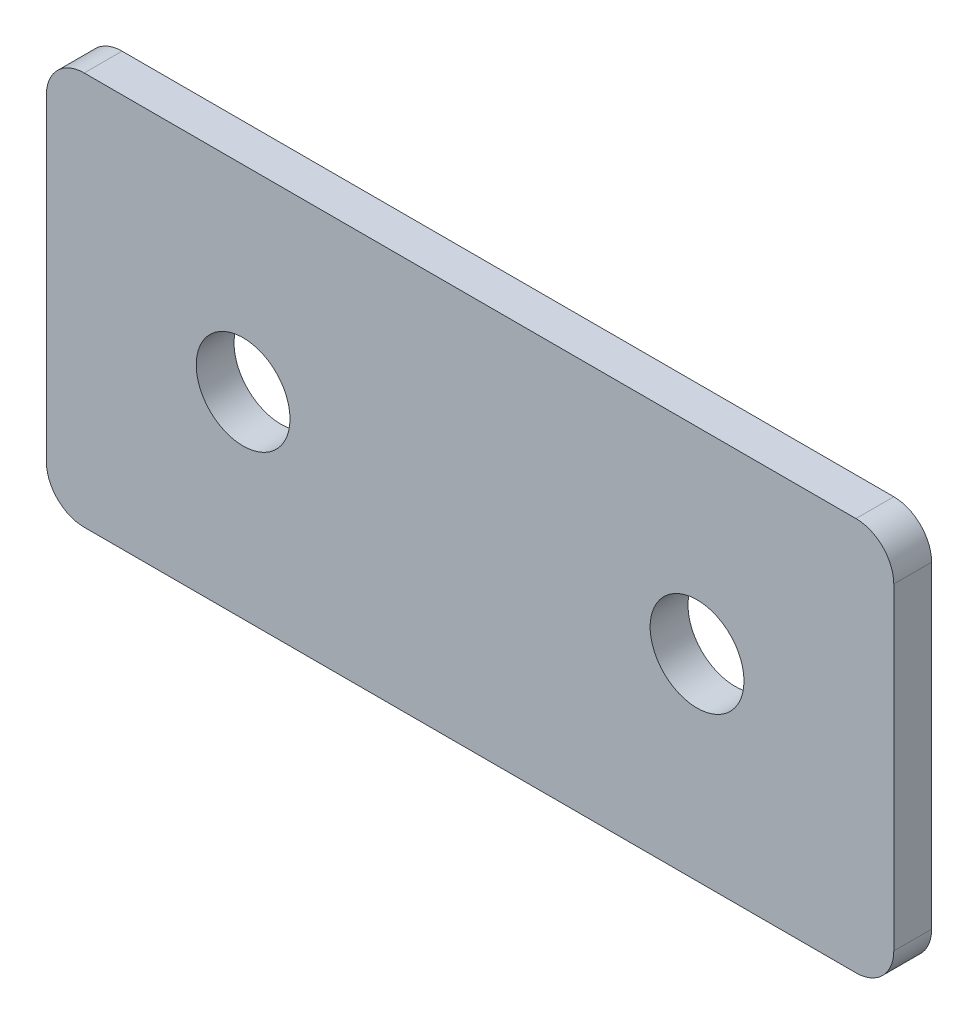
ISO-10303-21;
HEADER;
FILE_DESCRIPTION(('STEP AP214'),'2;1');
FILE_NAME('part.step','',(''),(''),'','','');
FILE_SCHEMA(('AUTOMOTIVE_DESIGN { 1 0 10303 214 1 1 1 1 }'));
ENDSEC;
DATA;
#1=APPLICATION_CONTEXT('core data for automotive mechanical design processes');
#2=APPLICATION_PROTOCOL_DEFINITION('international standard','automotive_design',2000,#1);
#3=PRODUCT_CONTEXT('',#1,'mechanical');
#4=PRODUCT('Part','Part','',(#3));
#5=PRODUCT_RELATED_PRODUCT_CATEGORY('part','',(#4));
#6=PRODUCT_DEFINITION_FORMATION('','',#4);
#7=PRODUCT_DEFINITION_CONTEXT('part definition',#1,'design');
#8=PRODUCT_DEFINITION('design','',#6,#7);
#9=PRODUCT_DEFINITION_SHAPE('','',#8);
#10=(LENGTH_UNIT() NAMED_UNIT(*) SI_UNIT(.MILLI.,.METRE.));
#11=(NAMED_UNIT(*) PLANE_ANGLE_UNIT() SI_UNIT($,.RADIAN.));
#12=(NAMED_UNIT(*) SI_UNIT($,.STERADIAN.) SOLID_ANGLE_UNIT());
#13=UNCERTAINTY_MEASURE_WITH_UNIT(LENGTH_MEASURE(1.E-05),#10,'distance_accuracy_value','');
#14=(GEOMETRIC_REPRESENTATION_CONTEXT(3) GLOBAL_UNCERTAINTY_ASSIGNED_CONTEXT((#13)) GLOBAL_UNIT_ASSIGNED_CONTEXT((#10,
#11,#12)) REPRESENTATION_CONTEXT('',''));
#15=CARTESIAN_POINT('',(0.,0.,0.));
#16=DIRECTION('',(0.,0.,1.));
#17=DIRECTION('',(1.,0.,0.));
#18=AXIS2_PLACEMENT_3D('',#15,#16,#17);
#19=CARTESIAN_POINT('',(-16.3611704944196,1.29837341341953,1.31300808576043));
#20=DIRECTION('',(0.,0.,-1.));
#21=DIRECTION('',(-1.,0.,0.));
#22=AXIS2_PLACEMENT_3D('',#19,#20,#21);
#23=PLANE('',#22);
#24=CARTESIAN_POINT('',(13.6388295055804,1.29837341341954,1.31300808576043));
#25=DIRECTION('',(0.,0.,1.));
#26=DIRECTION('',(1.,0.,0.));
#27=AXIS2_PLACEMENT_3D('',#24,#25,#26);
#28=CIRCLE('',#27,3.1);
#29=CARTESIAN_POINT('',(16.7388295055804,1.29837341341954,1.31300808576043));
#30=VERTEX_POINT('',#29);
#31=EDGE_CURVE('E154',#30,#30,#28,.T.);
#32=ORIENTED_EDGE('',*,*,#31,.F.);
#33=EDGE_LOOP('',(#32));
#34=FACE_BOUND('',#33,.T.);
#35=CARTESIAN_POINT('',(-16.3611704944196,1.29837341341954,1.31300808576043));
#36=DIRECTION('',(0.,0.,1.));
#37=DIRECTION('',(1.,0.,0.));
#38=AXIS2_PLACEMENT_3D('',#35,#36,#37);
#39=CIRCLE('',#38,3.1);
#40=CARTESIAN_POINT('',(-13.2611704944196,1.29837341341954,1.31300808576043));
#41=VERTEX_POINT('',#40);
#42=EDGE_CURVE('E107',#41,#41,#39,.T.);
#43=ORIENTED_EDGE('',*,*,#42,.F.);
#44=EDGE_LOOP('',(#43));
#45=FACE_BOUND('',#44,.T.);
#46=DIRECTION('',(1.,0.,0.));
#47=VECTOR('',#46,1.);
#48=CARTESIAN_POINT('',(-29.3611704944196,-11.7016265865805,1.31300808576043));
#49=LINE('',#48,#47);
#50=CARTESIAN_POINT('',(-26.8611704944196,-11.7016265865805,1.31300808576043));
#51=VERTEX_POINT('',#50);
#52=CARTESIAN_POINT('',(24.1388295055803,-11.7016265865805,1.31300808576043));
#53=VERTEX_POINT('',#52);
#54=EDGE_CURVE('E84',#51,#53,#49,.T.);
#55=ORIENTED_EDGE('',*,*,#54,.T.);
#56=CARTESIAN_POINT('',(24.1388295055804,-9.20162658658046,1.31300808576043));
#57=DIRECTION('',(0.,0.,-1.));
#58=DIRECTION('',(-1.,0.,0.));
#59=AXIS2_PLACEMENT_3D('',#56,#57,#58);
#60=CIRCLE('',#59,2.5);
#61=CARTESIAN_POINT('',(26.6388295055804,-9.20162658658046,1.31300808576043));
#62=VERTEX_POINT('',#61);
#63=EDGE_CURVE('E91',#53,#62,#60,.F.);
#64=ORIENTED_EDGE('',*,*,#63,.T.);
#65=DIRECTION('',(0.,1.,0.));
#66=VECTOR('',#65,1.);
#67=CARTESIAN_POINT('',(26.6388295055804,-11.7016265865805,1.31300808576043));
#68=LINE('',#67,#66);
#69=CARTESIAN_POINT('',(26.6388295055804,11.7983734134195,1.31300808576043));
#70=VERTEX_POINT('',#69);
#71=EDGE_CURVE('E102',#62,#70,#68,.T.);
#72=ORIENTED_EDGE('',*,*,#71,.T.);
#73=CARTESIAN_POINT('',(24.1388295055804,11.7983734134195,1.31300808576043));
#74=DIRECTION('',(0.,0.,-1.));
#75=DIRECTION('',(-1.,0.,0.));
#76=AXIS2_PLACEMENT_3D('',#73,#74,#75);
#77=CIRCLE('',#76,2.5);
#78=CARTESIAN_POINT('',(24.1388295055804,14.2983734134195,1.31300808576043));
#79=VERTEX_POINT('',#78);
#80=EDGE_CURVE('E109',#70,#79,#77,.F.);
#81=ORIENTED_EDGE('',*,*,#80,.T.);
#82=DIRECTION('',(-1.,0.,0.));
#83=VECTOR('',#82,1.);
#84=CARTESIAN_POINT('',(26.6388295055804,14.2983734134195,1.31300808576043));
#85=LINE('',#84,#83);
#86=CARTESIAN_POINT('',(-26.8611704944196,14.2983734134195,1.31300808576043));
#87=VERTEX_POINT('',#86);
#88=EDGE_CURVE('E139',#79,#87,#85,.T.);
#89=ORIENTED_EDGE('',*,*,#88,.T.);
#90=CARTESIAN_POINT('',(-26.8611704944196,11.7983734134195,1.31300808576043));
#91=DIRECTION('',(0.,0.,-1.));
#92=DIRECTION('',(-1.,0.,0.));
#93=AXIS2_PLACEMENT_3D('',#90,#91,#92);
#94=CIRCLE('',#93,2.5);
#95=CARTESIAN_POINT('',(-29.3611704944196,11.7983734134195,1.31300808576043));
#96=VERTEX_POINT('',#95);
#97=EDGE_CURVE('E92',#87,#96,#94,.F.);
#98=ORIENTED_EDGE('',*,*,#97,.T.);
#99=DIRECTION('',(0.,-1.,0.));
#100=VECTOR('',#99,1.);
#101=CARTESIAN_POINT('',(-29.3611704944196,14.2983734134195,1.31300808576043));
#102=LINE('',#101,#100);
#103=CARTESIAN_POINT('',(-29.3611704944196,-9.20162658658045,1.31300808576043));
#104=VERTEX_POINT('',#103);
#105=EDGE_CURVE('E86',#96,#104,#102,.T.);
#106=ORIENTED_EDGE('',*,*,#105,.T.);
#107=CARTESIAN_POINT('',(-26.8611704944196,-9.20162658658046,1.31300808576043));
#108=DIRECTION('',(0.,0.,-1.));
#109=DIRECTION('',(-1.,0.,0.));
#110=AXIS2_PLACEMENT_3D('',#107,#108,#109);
#111=CIRCLE('',#110,2.5);
#112=EDGE_CURVE('E82',#104,#51,#111,.F.);
#113=ORIENTED_EDGE('',*,*,#112,.T.);
#114=EDGE_LOOP('',(#55,#64,#72,#81,#89,#98,#106,#113));
#115=FACE_BOUND('',#114,.T.);
#116=ADVANCED_FACE('F16',(#34,#45,#115),#23,.F.);
#117=CARTESIAN_POINT('',(-16.3611704944196,1.29837341341953,-1.18699191423957));
#118=DIRECTION('',(0.,0.,-1.));
#119=DIRECTION('',(-1.,0.,0.));
#120=AXIS2_PLACEMENT_3D('',#117,#118,#119);
#121=PLANE('',#120);
#122=CARTESIAN_POINT('',(13.6388295055804,1.29837341341954,-1.18699191423957));
#123=DIRECTION('',(0.,0.,1.));
#124=DIRECTION('',(1.,0.,0.));
#125=AXIS2_PLACEMENT_3D('',#122,#123,#124);
#126=CIRCLE('',#125,3.1);
#127=CARTESIAN_POINT('',(16.7388295055804,1.29837341341954,-1.18699191423957));
#128=VERTEX_POINT('',#127);
#129=EDGE_CURVE('E150',#128,#128,#126,.T.);
#130=ORIENTED_EDGE('',*,*,#129,.T.);
#131=EDGE_LOOP('',(#130));
#132=FACE_BOUND('',#131,.T.);
#133=CARTESIAN_POINT('',(-16.3611704944196,1.29837341341954,-1.18699191423957));
#134=DIRECTION('',(0.,0.,1.));
#135=DIRECTION('',(1.,0.,0.));
#136=AXIS2_PLACEMENT_3D('',#133,#134,#135);
#137=CIRCLE('',#136,3.1);
#138=CARTESIAN_POINT('',(-13.2611704944196,1.29837341341954,-1.18699191423957));
#139=VERTEX_POINT('',#138);
#140=EDGE_CURVE('E112',#139,#139,#137,.T.);
#141=ORIENTED_EDGE('',*,*,#140,.T.);
#142=EDGE_LOOP('',(#141));
#143=FACE_BOUND('',#142,.T.);
#144=DIRECTION('',(0.,1.,0.));
#145=VECTOR('',#144,1.);
#146=CARTESIAN_POINT('',(26.6388295055804,-11.7016265865805,-1.18699191423957));
#147=LINE('',#146,#145);
#148=CARTESIAN_POINT('',(26.6388295055804,-9.20162658658046,-1.18699191423957));
#149=VERTEX_POINT('',#148);
#150=CARTESIAN_POINT('',(26.6388295055804,11.7983734134195,-1.18699191423957));
#151=VERTEX_POINT('',#150);
#152=EDGE_CURVE('E141',#149,#151,#147,.T.);
#153=ORIENTED_EDGE('',*,*,#152,.F.);
#154=CARTESIAN_POINT('',(24.1388295055804,-9.20162658658046,-1.18699191423957));
#155=DIRECTION('',(0.,0.,-1.));
#156=DIRECTION('',(-1.,0.,0.));
#157=AXIS2_PLACEMENT_3D('',#154,#155,#156);
#158=CIRCLE('',#157,2.5);
#159=CARTESIAN_POINT('',(24.1388295055803,-11.7016265865805,-1.18699191423957));
#160=VERTEX_POINT('',#159);
#161=EDGE_CURVE('E128',#149,#160,#158,.T.);
#162=ORIENTED_EDGE('',*,*,#161,.T.);
#163=DIRECTION('',(1.,0.,0.));
#164=VECTOR('',#163,1.);
#165=CARTESIAN_POINT('',(-29.3611704944196,-11.7016265865805,-1.18699191423957));
#166=LINE('',#165,#164);
#167=CARTESIAN_POINT('',(-26.8611704944196,-11.7016265865805,-1.18699191423957));
#168=VERTEX_POINT('',#167);
#169=EDGE_CURVE('E138',#168,#160,#166,.T.);
#170=ORIENTED_EDGE('',*,*,#169,.F.);
#171=CARTESIAN_POINT('',(-26.8611704944196,-9.20162658658046,-1.18699191423957));
#172=DIRECTION('',(0.,0.,-1.));
#173=DIRECTION('',(-1.,0.,0.));
#174=AXIS2_PLACEMENT_3D('',#171,#172,#173);
#175=CIRCLE('',#174,2.5);
#176=CARTESIAN_POINT('',(-29.3611704944196,-9.20162658658045,-1.18699191423957));
#177=VERTEX_POINT('',#176);
#178=EDGE_CURVE('E106',#168,#177,#175,.T.);
#179=ORIENTED_EDGE('',*,*,#178,.T.);
#180=DIRECTION('',(0.,-1.,0.));
#181=VECTOR('',#180,1.);
#182=CARTESIAN_POINT('',(-29.3611704944196,14.2983734134195,-1.18699191423957));
#183=LINE('',#182,#181);
#184=CARTESIAN_POINT('',(-29.3611704944196,11.7983734134195,-1.18699191423957));
#185=VERTEX_POINT('',#184);
#186=EDGE_CURVE('E137',#185,#177,#183,.T.);
#187=ORIENTED_EDGE('',*,*,#186,.F.);
#188=CARTESIAN_POINT('',(-26.8611704944196,11.7983734134195,-1.18699191423957));
#189=DIRECTION('',(0.,0.,-1.));
#190=DIRECTION('',(-1.,0.,0.));
#191=AXIS2_PLACEMENT_3D('',#188,#189,#190);
#192=CIRCLE('',#191,2.5);
#193=CARTESIAN_POINT('',(-26.8611704944196,14.2983734134195,-1.18699191423957));
#194=VERTEX_POINT('',#193);
#195=EDGE_CURVE('E31',#185,#194,#192,.T.);
#196=ORIENTED_EDGE('',*,*,#195,.T.);
#197=DIRECTION('',(-1.,0.,0.));
#198=VECTOR('',#197,1.);
#199=CARTESIAN_POINT('',(26.6388295055804,14.2983734134195,-1.18699191423957));
#200=LINE('',#199,#198);
#201=CARTESIAN_POINT('',(24.1388295055804,14.2983734134195,-1.18699191423957));
#202=VERTEX_POINT('',#201);
#203=EDGE_CURVE('E148',#202,#194,#200,.T.);
#204=ORIENTED_EDGE('',*,*,#203,.F.);
#205=CARTESIAN_POINT('',(24.1388295055804,11.7983734134195,-1.18699191423957));
#206=DIRECTION('',(0.,0.,-1.));
#207=DIRECTION('',(-1.,0.,0.));
#208=AXIS2_PLACEMENT_3D('',#205,#206,#207);
#209=CIRCLE('',#208,2.5);
#210=EDGE_CURVE('E124',#202,#151,#209,.T.);
#211=ORIENTED_EDGE('',*,*,#210,.T.);
#212=EDGE_LOOP('',(#153,#162,#170,#179,#187,#196,#204,#211));
#213=FACE_BOUND('',#212,.T.);
#214=ADVANCED_FACE('F160',(#132,#143,#213),#121,.T.);
#215=CARTESIAN_POINT('',(-16.3611704944196,1.29837341341954,1.31300808576043));
#216=DIRECTION('',(0.,0.,-1.));
#217=DIRECTION('',(-1.,0.,0.));
#218=AXIS2_PLACEMENT_3D('',#215,#216,#217);
#219=CYLINDRICAL_SURFACE('',#218,3.1);
#220=ORIENTED_EDGE('',*,*,#42,.T.);
#221=EDGE_LOOP('',(#220));
#222=FACE_BOUND('',#221,.T.);
#223=ORIENTED_EDGE('',*,*,#140,.F.);
#224=EDGE_LOOP('',(#223));
#225=FACE_BOUND('',#224,.T.);
#226=ADVANCED_FACE('F165',(#222,#225),#219,.F.);
#227=CARTESIAN_POINT('',(13.6388295055804,1.29837341341954,1.31300808576043));
#228=DIRECTION('',(0.,0.,-1.));
#229=DIRECTION('',(-1.,0.,0.));
#230=AXIS2_PLACEMENT_3D('',#227,#228,#229);
#231=CYLINDRICAL_SURFACE('',#230,3.1);
#232=ORIENTED_EDGE('',*,*,#31,.T.);
#233=EDGE_LOOP('',(#232));
#234=FACE_BOUND('',#233,.T.);
#235=ORIENTED_EDGE('',*,*,#129,.F.);
#236=EDGE_LOOP('',(#235));
#237=FACE_BOUND('',#236,.T.);
#238=ADVANCED_FACE('F163',(#234,#237),#231,.F.);
#239=CARTESIAN_POINT('',(-29.3611704944196,14.2983734134195,-1.18699191423957));
#240=DIRECTION('',(-1.,0.,0.));
#241=DIRECTION('',(0.,0.,1.));
#242=AXIS2_PLACEMENT_3D('',#239,#240,#241);
#243=PLANE('',#242);
#244=ORIENTED_EDGE('',*,*,#186,.T.);
#245=DIRECTION('',(0.,0.,1.));
#246=VECTOR('',#245,1.);
#247=CARTESIAN_POINT('',(-29.3611704944196,-9.20162658658046,-1.18699191423957));
#248=LINE('',#247,#246);
#249=EDGE_CURVE('E132',#177,#104,#248,.T.);
#250=ORIENTED_EDGE('',*,*,#249,.T.);
#251=ORIENTED_EDGE('',*,*,#105,.F.);
#252=DIRECTION('',(0.,0.,1.));
#253=VECTOR('',#252,1.);
#254=CARTESIAN_POINT('',(-29.3611704944196,11.7983734134195,-1.18699191423957));
#255=LINE('',#254,#253);
#256=EDGE_CURVE('E130',#96,#185,#255,.F.);
#257=ORIENTED_EDGE('',*,*,#256,.T.);
#258=EDGE_LOOP('',(#244,#250,#251,#257));
#259=FACE_BOUND('',#258,.T.);
#260=ADVANCED_FACE('F135',(#259),#243,.T.);
#261=CARTESIAN_POINT('',(26.6388295055804,14.2983734134195,-1.18699191423957));
#262=DIRECTION('',(0.,1.,0.));
#263=DIRECTION('',(0.,0.,1.));
#264=AXIS2_PLACEMENT_3D('',#261,#262,#263);
#265=PLANE('',#264);
#266=ORIENTED_EDGE('',*,*,#203,.T.);
#267=DIRECTION('',(0.,0.,1.));
#268=VECTOR('',#267,1.);
#269=CARTESIAN_POINT('',(-26.8611704944196,14.2983734134195,-1.18699191423957));
#270=LINE('',#269,#268);
#271=EDGE_CURVE('E10',#194,#87,#270,.T.);
#272=ORIENTED_EDGE('',*,*,#271,.T.);
#273=ORIENTED_EDGE('',*,*,#88,.F.);
#274=DIRECTION('',(0.,0.,1.));
#275=VECTOR('',#274,1.);
#276=CARTESIAN_POINT('',(24.1388295055804,14.2983734134195,-1.18699191423957));
#277=LINE('',#276,#275);
#278=EDGE_CURVE('E24',#79,#202,#277,.F.);
#279=ORIENTED_EDGE('',*,*,#278,.T.);
#280=EDGE_LOOP('',(#266,#272,#273,#279));
#281=FACE_BOUND('',#280,.T.);
#282=ADVANCED_FACE('F173',(#281),#265,.T.);
#283=CARTESIAN_POINT('',(26.6388295055804,-11.7016265865805,-1.18699191423957));
#284=DIRECTION('',(1.,0.,0.));
#285=DIRECTION('',(0.,0.,-1.));
#286=AXIS2_PLACEMENT_3D('',#283,#284,#285);
#287=PLANE('',#286);
#288=ORIENTED_EDGE('',*,*,#71,.F.);
#289=DIRECTION('',(0.,0.,1.));
#290=VECTOR('',#289,1.);
#291=CARTESIAN_POINT('',(26.6388295055804,-9.20162658658046,-1.18699191423957));
#292=LINE('',#291,#290);
#293=EDGE_CURVE('E122',#62,#149,#292,.F.);
#294=ORIENTED_EDGE('',*,*,#293,.T.);
#295=ORIENTED_EDGE('',*,*,#152,.T.);
#296=DIRECTION('',(0.,0.,1.));
#297=VECTOR('',#296,1.);
#298=CARTESIAN_POINT('',(26.6388295055804,11.7983734134195,-1.18699191423957));
#299=LINE('',#298,#297);
#300=EDGE_CURVE('E119',#151,#70,#299,.T.);
#301=ORIENTED_EDGE('',*,*,#300,.T.);
#302=EDGE_LOOP('',(#288,#294,#295,#301));
#303=FACE_BOUND('',#302,.T.);
#304=ADVANCED_FACE('F204',(#303),#287,.T.);
#305=CARTESIAN_POINT('',(-29.3611704944196,-11.7016265865805,-1.18699191423957));
#306=DIRECTION('',(0.,-1.,0.));
#307=DIRECTION('',(0.,0.,-1.));
#308=AXIS2_PLACEMENT_3D('',#305,#306,#307);
#309=PLANE('',#308);
#310=ORIENTED_EDGE('',*,*,#169,.T.);
#311=DIRECTION('',(0.,0.,1.));
#312=VECTOR('',#311,1.);
#313=CARTESIAN_POINT('',(24.1388295055804,-11.7016265865805,-1.18699191423957));
#314=LINE('',#313,#312);
#315=EDGE_CURVE('E101',#160,#53,#314,.T.);
#316=ORIENTED_EDGE('',*,*,#315,.T.);
#317=ORIENTED_EDGE('',*,*,#54,.F.);
#318=DIRECTION('',(0.,0.,1.));
#319=VECTOR('',#318,1.);
#320=CARTESIAN_POINT('',(-26.8611704944196,-11.7016265865805,-1.18699191423957));
#321=LINE('',#320,#319);
#322=EDGE_CURVE('E98',#51,#168,#321,.F.);
#323=ORIENTED_EDGE('',*,*,#322,.T.);
#324=EDGE_LOOP('',(#310,#316,#317,#323));
#325=FACE_BOUND('',#324,.T.);
#326=ADVANCED_FACE('F97',(#325),#309,.T.);
#327=CARTESIAN_POINT('',(24.1388295055804,-9.20162658658046,-1.18699191423957));
#328=DIRECTION('',(0.,0.,1.));
#329=DIRECTION('',(1.,0.,0.));
#330=AXIS2_PLACEMENT_3D('',#327,#328,#329);
#331=CYLINDRICAL_SURFACE('',#330,2.5);
#332=ORIENTED_EDGE('',*,*,#161,.F.);
#333=ORIENTED_EDGE('',*,*,#293,.F.);
#334=ORIENTED_EDGE('',*,*,#63,.F.);
#335=ORIENTED_EDGE('',*,*,#315,.F.);
#336=EDGE_LOOP('',(#332,#333,#334,#335));
#337=FACE_BOUND('',#336,.T.);
#338=ADVANCED_FACE('F187',(#337),#331,.T.);
#339=CARTESIAN_POINT('',(-26.8611704944196,-9.20162658658046,-1.18699191423957));
#340=DIRECTION('',(0.,0.,1.));
#341=DIRECTION('',(1.,0.,0.));
#342=AXIS2_PLACEMENT_3D('',#339,#340,#341);
#343=CYLINDRICAL_SURFACE('',#342,2.5);
#344=ORIENTED_EDGE('',*,*,#178,.F.);
#345=ORIENTED_EDGE('',*,*,#322,.F.);
#346=ORIENTED_EDGE('',*,*,#112,.F.);
#347=ORIENTED_EDGE('',*,*,#249,.F.);
#348=EDGE_LOOP('',(#344,#345,#346,#347));
#349=FACE_BOUND('',#348,.T.);
#350=ADVANCED_FACE('F105',(#349),#343,.T.);
#351=CARTESIAN_POINT('',(-26.8611704944196,11.7983734134195,-1.18699191423957));
#352=DIRECTION('',(0.,0.,1.));
#353=DIRECTION('',(1.,0.,0.));
#354=AXIS2_PLACEMENT_3D('',#351,#352,#353);
#355=CYLINDRICAL_SURFACE('',#354,2.5);
#356=ORIENTED_EDGE('',*,*,#195,.F.);
#357=ORIENTED_EDGE('',*,*,#256,.F.);
#358=ORIENTED_EDGE('',*,*,#97,.F.);
#359=ORIENTED_EDGE('',*,*,#271,.F.);
#360=EDGE_LOOP('',(#356,#357,#358,#359));
#361=FACE_BOUND('',#360,.T.);
#362=ADVANCED_FACE('F192',(#361),#355,.T.);
#363=CARTESIAN_POINT('',(24.1388295055804,11.7983734134195,-1.18699191423957));
#364=DIRECTION('',(0.,0.,1.));
#365=DIRECTION('',(1.,0.,0.));
#366=AXIS2_PLACEMENT_3D('',#363,#364,#365);
#367=CYLINDRICAL_SURFACE('',#366,2.5);
#368=ORIENTED_EDGE('',*,*,#210,.F.);
#369=ORIENTED_EDGE('',*,*,#278,.F.);
#370=ORIENTED_EDGE('',*,*,#80,.F.);
#371=ORIENTED_EDGE('',*,*,#300,.F.);
#372=EDGE_LOOP('',(#368,#369,#370,#371));
#373=FACE_BOUND('',#372,.T.);
#374=ADVANCED_FACE('F18',(#373),#367,.T.);
#375=CLOSED_SHELL('',(#116,#214,#226,#238,#260,#282,#304,#326,#338,#350,#362,#374));
#376=MANIFOLD_SOLID_BREP('B1',#375);
#377=ADVANCED_BREP_SHAPE_REPRESENTATION('',(#18,#376),#14);
#378=SHAPE_DEFINITION_REPRESENTATION(#9,#377);
ENDSEC;
END-ISO-10303-21;
